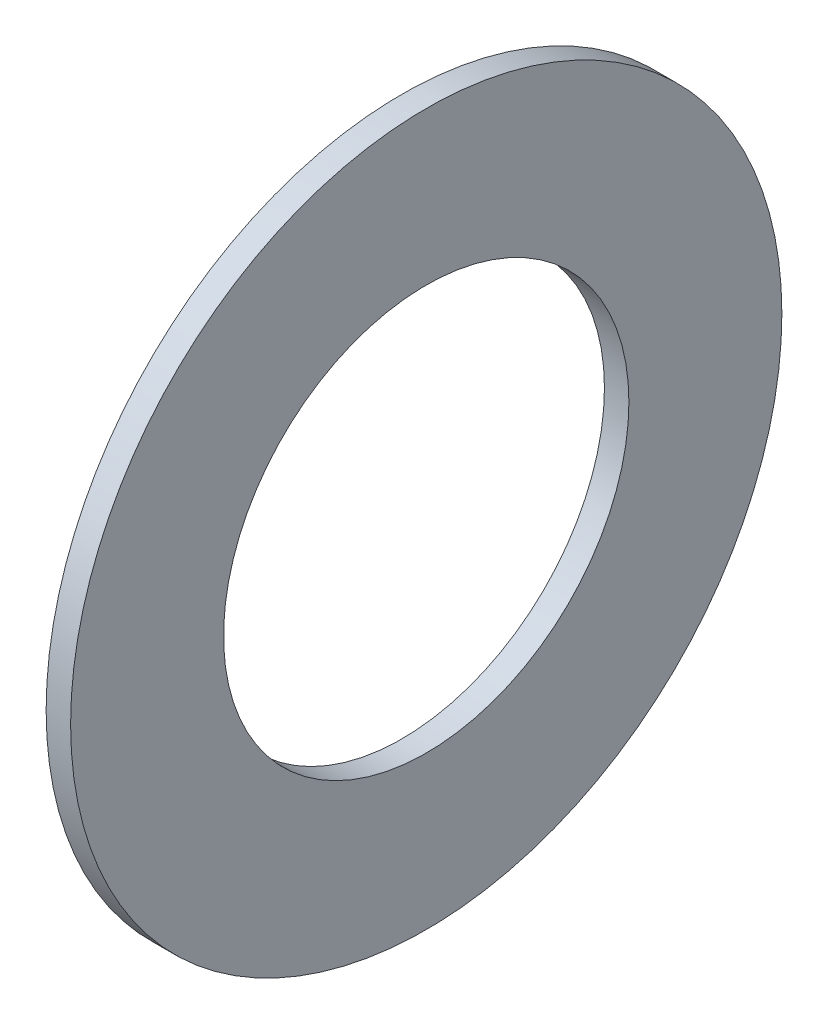
ISO-10303-21;
HEADER;
FILE_DESCRIPTION(('STEP AP214'),'2;1');
FILE_NAME('part.step','',(''),(''),'','','');
FILE_SCHEMA(('AUTOMOTIVE_DESIGN { 1 0 10303 214 1 1 1 1 }'));
ENDSEC;
DATA;
#1=APPLICATION_CONTEXT('core data for automotive mechanical design processes');
#2=APPLICATION_PROTOCOL_DEFINITION('international standard','automotive_design',2000,#1);
#3=PRODUCT_CONTEXT('',#1,'mechanical');
#4=PRODUCT('Part','Part','',(#3));
#5=PRODUCT_RELATED_PRODUCT_CATEGORY('part','',(#4));
#6=PRODUCT_DEFINITION_FORMATION('','',#4);
#7=PRODUCT_DEFINITION_CONTEXT('part definition',#1,'design');
#8=PRODUCT_DEFINITION('design','',#6,#7);
#9=PRODUCT_DEFINITION_SHAPE('','',#8);
#10=(LENGTH_UNIT() NAMED_UNIT(*) SI_UNIT(.MILLI.,.METRE.));
#11=(NAMED_UNIT(*) PLANE_ANGLE_UNIT() SI_UNIT($,.RADIAN.));
#12=(NAMED_UNIT(*) SI_UNIT($,.STERADIAN.) SOLID_ANGLE_UNIT());
#13=UNCERTAINTY_MEASURE_WITH_UNIT(LENGTH_MEASURE(1.E-05),#10,'distance_accuracy_value','');
#14=(GEOMETRIC_REPRESENTATION_CONTEXT(3) GLOBAL_UNCERTAINTY_ASSIGNED_CONTEXT((#13)) GLOBAL_UNIT_ASSIGNED_CONTEXT((#10,
#11,#12)) REPRESENTATION_CONTEXT('',''));
#15=CARTESIAN_POINT('',(0.,0.,0.));
#16=DIRECTION('',(0.,0.,1.));
#17=DIRECTION('',(1.,0.,0.));
#18=AXIS2_PLACEMENT_3D('',#15,#16,#17);
#19=CARTESIAN_POINT('',(0.8128,0.,0.));
#20=DIRECTION('',(1.,0.,0.));
#21=DIRECTION('',(0.,0.,-1.));
#22=AXIS2_PLACEMENT_3D('',#19,#20,#21);
#23=PLANE('',#22);
#24=CARTESIAN_POINT('',(0.8128,0.,0.));
#25=DIRECTION('',(1.,0.,0.));
#26=DIRECTION('',(0.,0.,-1.));
#27=AXIS2_PLACEMENT_3D('',#24,#25,#26);
#28=CIRCLE('',#27,11.811);
#29=CARTESIAN_POINT('',(0.8128,0.,-11.811));
#30=VERTEX_POINT('',#29);
#31=EDGE_CURVE('E10',#30,#30,#28,.T.);
#32=ORIENTED_EDGE('',*,*,#31,.T.);
#33=EDGE_LOOP('',(#32));
#34=FACE_BOUND('',#33,.T.);
#35=CARTESIAN_POINT('',(0.8128,0.,0.));
#36=DIRECTION('',(1.,0.,0.));
#37=DIRECTION('',(0.,0.,-1.));
#38=AXIS2_PLACEMENT_3D('',#35,#36,#37);
#39=CIRCLE('',#38,6.731);
#40=CARTESIAN_POINT('',(0.8128,0.,-6.731));
#41=VERTEX_POINT('',#40);
#42=EDGE_CURVE('E44',#41,#41,#39,.T.);
#43=ORIENTED_EDGE('',*,*,#42,.F.);
#44=EDGE_LOOP('',(#43));
#45=FACE_BOUND('',#44,.T.);
#46=ADVANCED_FACE('F33',(#34,#45),#23,.T.);
#47=CARTESIAN_POINT('',(0.,0.,0.));
#48=DIRECTION('',(1.,0.,0.));
#49=DIRECTION('',(0.,0.,-1.));
#50=AXIS2_PLACEMENT_3D('',#47,#48,#49);
#51=PLANE('',#50);
#52=CARTESIAN_POINT('',(0.,0.,0.));
#53=DIRECTION('',(1.,0.,0.));
#54=DIRECTION('',(0.,0.,-1.));
#55=AXIS2_PLACEMENT_3D('',#52,#53,#54);
#56=CIRCLE('',#55,11.811);
#57=CARTESIAN_POINT('',(0.,0.,-11.811));
#58=VERTEX_POINT('',#57);
#59=EDGE_CURVE('E37',#58,#58,#56,.T.);
#60=ORIENTED_EDGE('',*,*,#59,.F.);
#61=EDGE_LOOP('',(#60));
#62=FACE_BOUND('',#61,.T.);
#63=CARTESIAN_POINT('',(0.,0.,0.));
#64=DIRECTION('',(1.,0.,0.));
#65=DIRECTION('',(0.,0.,-1.));
#66=AXIS2_PLACEMENT_3D('',#63,#64,#65);
#67=CIRCLE('',#66,6.731);
#68=CARTESIAN_POINT('',(0.,0.,-6.731));
#69=VERTEX_POINT('',#68);
#70=EDGE_CURVE('E46',#69,#69,#67,.T.);
#71=ORIENTED_EDGE('',*,*,#70,.T.);
#72=EDGE_LOOP('',(#71));
#73=FACE_BOUND('',#72,.T.);
#74=ADVANCED_FACE('F56',(#62,#73),#51,.F.);
#75=CARTESIAN_POINT('',(0.8128,0.,0.));
#76=DIRECTION('',(-1.,0.,0.));
#77=DIRECTION('',(0.,0.,1.));
#78=AXIS2_PLACEMENT_3D('',#75,#76,#77);
#79=CYLINDRICAL_SURFACE('',#78,11.811);
#80=ORIENTED_EDGE('',*,*,#31,.F.);
#81=EDGE_LOOP('',(#80));
#82=FACE_BOUND('',#81,.T.);
#83=ORIENTED_EDGE('',*,*,#59,.T.);
#84=EDGE_LOOP('',(#83));
#85=FACE_BOUND('',#84,.T.);
#86=ADVANCED_FACE('F35',(#82,#85),#79,.T.);
#87=CARTESIAN_POINT('',(0.8128,0.,0.));
#88=DIRECTION('',(-1.,0.,0.));
#89=DIRECTION('',(0.,0.,1.));
#90=AXIS2_PLACEMENT_3D('',#87,#88,#89);
#91=CYLINDRICAL_SURFACE('',#90,6.731);
#92=ORIENTED_EDGE('',*,*,#42,.T.);
#93=EDGE_LOOP('',(#92));
#94=FACE_BOUND('',#93,.T.);
#95=ORIENTED_EDGE('',*,*,#70,.F.);
#96=EDGE_LOOP('',(#95));
#97=FACE_BOUND('',#96,.T.);
#98=ADVANCED_FACE('F52',(#94,#97),#91,.F.);
#99=CLOSED_SHELL('',(#46,#74,#86,#98));
#100=MANIFOLD_SOLID_BREP('B2',#99);
#101=ADVANCED_BREP_SHAPE_REPRESENTATION('',(#18,#100),#14);
#102=SHAPE_DEFINITION_REPRESENTATION(#9,#101);
ENDSEC;
END-ISO-10303-21;
